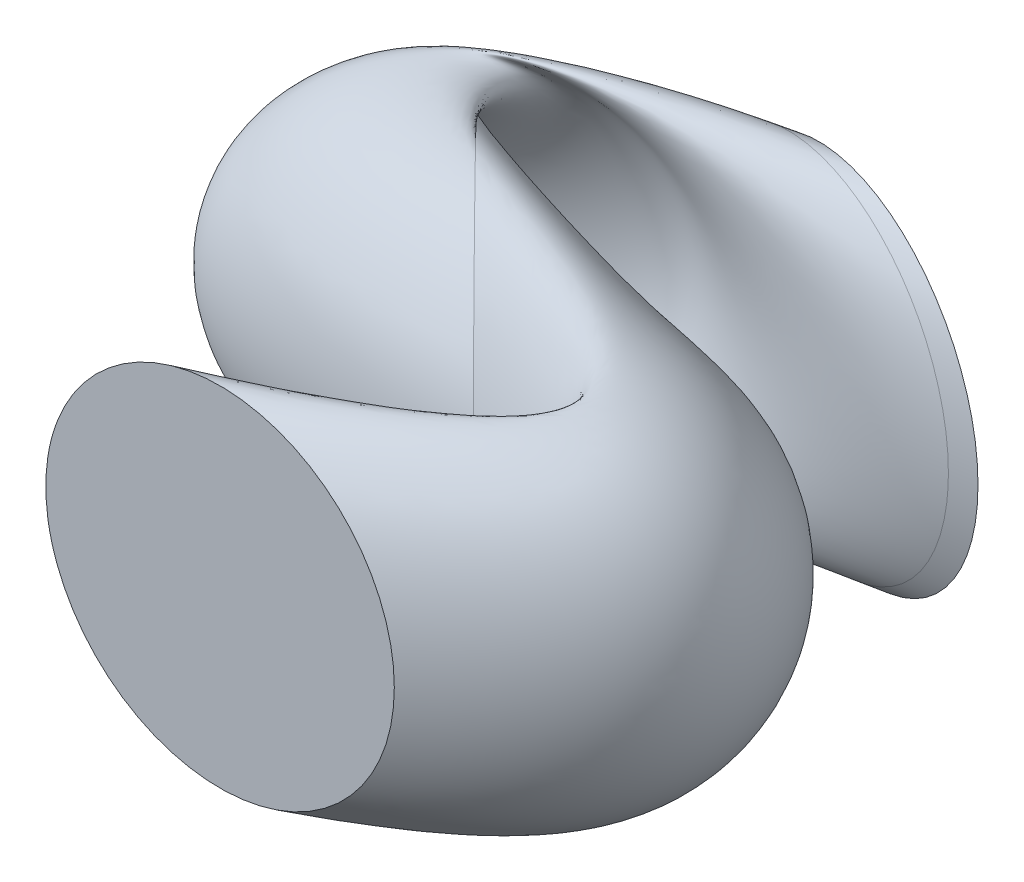
ISO-10303-21;
HEADER;
FILE_DESCRIPTION(('STEP AP214'),'2;1');
FILE_NAME('part.step','',(''),(''),'','','');
FILE_SCHEMA(('AUTOMOTIVE_DESIGN { 1 0 10303 214 1 1 1 1 }'));
ENDSEC;
DATA;
#1=APPLICATION_CONTEXT('core data for automotive mechanical design processes');
#2=APPLICATION_PROTOCOL_DEFINITION('international standard','automotive_design',2000,#1);
#3=PRODUCT_CONTEXT('',#1,'mechanical');
#4=PRODUCT('Part','Part','',(#3));
#5=PRODUCT_RELATED_PRODUCT_CATEGORY('part','',(#4));
#6=PRODUCT_DEFINITION_FORMATION('','',#4);
#7=PRODUCT_DEFINITION_CONTEXT('part definition',#1,'design');
#8=PRODUCT_DEFINITION('design','',#6,#7);
#9=PRODUCT_DEFINITION_SHAPE('','',#8);
#10=(LENGTH_UNIT() NAMED_UNIT(*) SI_UNIT(.MILLI.,.METRE.));
#11=(NAMED_UNIT(*) PLANE_ANGLE_UNIT() SI_UNIT($,.RADIAN.));
#12=(NAMED_UNIT(*) SI_UNIT($,.STERADIAN.) SOLID_ANGLE_UNIT());
#13=UNCERTAINTY_MEASURE_WITH_UNIT(LENGTH_MEASURE(1.E-05),#10,'distance_accuracy_value','');
#14=(GEOMETRIC_REPRESENTATION_CONTEXT(3) GLOBAL_UNCERTAINTY_ASSIGNED_CONTEXT((#13)) GLOBAL_UNIT_ASSIGNED_CONTEXT((#10,
#11,#12)) REPRESENTATION_CONTEXT('',''));
#15=CARTESIAN_POINT('',(0.,0.,0.));
#16=DIRECTION('',(0.,0.,1.));
#17=DIRECTION('',(1.,0.,0.));
#18=AXIS2_PLACEMENT_3D('',#15,#16,#17);
#19=CARTESIAN_POINT('',(13.8441242664834,0.,-58.1458268293369));
#20=DIRECTION('',(-0.224688082587893,0.,0.974430739223151));
#21=DIRECTION('',(0.974430739223151,0.,0.224688082587893));
#22=AXIS2_PLACEMENT_3D('',#19,#20,#21);
#23=PLANE('',#22);
#24=CARTESIAN_POINT('',(13.8441242664834,0.,-58.1458268293369));
#25=DIRECTION('',(0.224688082587893,0.,-0.974430739223151));
#26=DIRECTION('',(0.974430739223151,0.,0.224688082587893));
#27=AXIS2_PLACEMENT_3D('',#24,#25,#26);
#28=CIRCLE('',#27,20.);
#29=CARTESIAN_POINT('',(33.3327390509464,0.,-53.652065177579));
#30=VERTEX_POINT('',#29);
#31=EDGE_CURVE('E40',#30,#30,#28,.T.);
#32=ORIENTED_EDGE('',*,*,#31,.T.);
#33=EDGE_LOOP('',(#32));
#34=FACE_BOUND('',#33,.T.);
#35=ADVANCED_FACE('F37',(#34),#23,.F.);
#36=CARTESIAN_POINT('',(0.,0.,0.));
#37=DIRECTION('',(0.,0.,1.));
#38=DIRECTION('',(1.,0.,0.));
#39=AXIS2_PLACEMENT_3D('',#36,#37,#38);
#40=PLANE('',#39);
#41=CARTESIAN_POINT('',(0.,0.,0.));
#42=DIRECTION('',(0.,0.,1.));
#43=DIRECTION('',(1.,0.,0.));
#44=AXIS2_PLACEMENT_3D('',#41,#42,#43);
#45=CIRCLE('',#44,20.);
#46=CARTESIAN_POINT('',(20.,0.,0.));
#47=VERTEX_POINT('',#46);
#48=EDGE_CURVE('E51',#47,#47,#45,.T.);
#49=ORIENTED_EDGE('',*,*,#48,.T.);
#50=EDGE_LOOP('',(#49));
#51=FACE_BOUND('',#50,.T.);
#52=ADVANCED_FACE('F75',(#51),#40,.T.);
#53=CARTESIAN_POINT('',(30.4504022753852,0.,-53.1366231177138));
#54=CARTESIAN_POINT('',(31.3857494045259,0.,-53.3043710455547));
#55=CARTESIAN_POINT('',(32.3463716766783,0.,-53.4762856240853));
#56=CARTESIAN_POINT('',(33.3327390509464,0.,-53.652065177579));
#57=CARTESIAN_POINT('',(30.4504022753852,40.,-53.1366231177138));
#58=CARTESIAN_POINT('',(31.3857494045259,40.,-53.3043710455547));
#59=CARTESIAN_POINT('',(32.3463716766783,40.,-53.4762856240853));
#60=CARTESIAN_POINT('',(33.3327390509464,40.,-53.652065177579));
#61=CARTESIAN_POINT('',(-8.5843094441241,40.,-61.872315470607));
#62=CARTESIAN_POINT('',(-7.62921496120596,40.,-62.1276344761548));
#63=CARTESIAN_POINT('',(-6.64943285895494,40.,-62.3832527257945));
#64=CARTESIAN_POINT('',(-5.64449051797965,40.,-62.6395884810947));
#65=CARTESIAN_POINT('',(-8.584309444126,0.,-61.872315470607));
#66=CARTESIAN_POINT('',(-7.62921496120746,0.,-62.1276344761548));
#67=CARTESIAN_POINT('',(-6.64943285895583,0.,-62.3832527257945));
#68=CARTESIAN_POINT('',(-5.64449051797965,0.,-62.6395884810947));
#69=CARTESIAN_POINT('',(-8.58430944412789,-40.,-61.872315470607));
#70=CARTESIAN_POINT('',(-7.62921496120896,-40.,-62.1276344761548));
#71=CARTESIAN_POINT('',(-6.64943285895671,-40.,-62.3832527257945));
#72=CARTESIAN_POINT('',(-5.64449051797966,-40.,-62.6395884810947));
#73=CARTESIAN_POINT('',(30.4504022753852,-40.,-53.1366231177138));
#74=CARTESIAN_POINT('',(31.3857494045259,-40.,-53.3043710455547));
#75=CARTESIAN_POINT('',(32.3463716766783,-40.,-53.4762856240853));
#76=CARTESIAN_POINT('',(33.3327390509464,-40.,-53.652065177579));
#77=CARTESIAN_POINT('',(30.4504022753852,0.,-53.1366231177138));
#78=CARTESIAN_POINT('',(31.3857494045259,0.,-53.3043710455547));
#79=CARTESIAN_POINT('',(32.3463716766783,0.,-53.4762856240853));
#80=CARTESIAN_POINT('',(33.3327390509464,0.,-53.652065177579));
#81=(BOUNDED_SURFACE() B_SPLINE_SURFACE(3,3,((#53,#54,#55,#56),(#57,#58,#59,#60),(#61,#62,#63,
#64),(#65,#66,#67,#68),(#69,#70,#71,#72),(#73,#74,#75,#76),(#77,#78,#79,#80)),.UNSPECIFIED.,.T.,
.F.,.F.) B_SPLINE_SURFACE_WITH_KNOTS((4,3,4),(4,4),(0.,0.5,1.),(0.990343472065436,1.),
.UNSPECIFIED.) GEOMETRIC_REPRESENTATION_ITEM() RATIONAL_B_SPLINE_SURFACE(((1.,1.,1.,1.),
(0.333333333333333,0.333333333333333,0.333333333333333,0.333333333333333),(0.333333333333333,
0.333333333333333,0.333333333333333,0.333333333333333),(1.,1.,1.,1.),(0.333333333333333,
0.333333333333333,0.333333333333333,0.333333333333333),(0.333333333333333,0.333333333333333,
0.333333333333333,0.333333333333333),(1.,1.,1.,1.))) REPRESENTATION_ITEM('') SURFACE());
#82=CARTESIAN_POINT('',(30.4504022753852,0.,-53.1366231177138));
#83=CARTESIAN_POINT('',(30.4504022753852,40.,-53.1366231177138));
#84=CARTESIAN_POINT('',(-8.5843094441241,40.,-61.872315470607));
#85=CARTESIAN_POINT('',(-8.584309444126,0.,-61.872315470607));
#86=CARTESIAN_POINT('',(-8.58430944412789,-40.,-61.872315470607));
#87=CARTESIAN_POINT('',(30.4504022753852,-40.,-53.1366231177138));
#88=CARTESIAN_POINT('',(30.4504022753852,0.,-53.1366231177138));
#89=(BOUNDED_CURVE() B_SPLINE_CURVE(3,(#82,#83,#84,#85,#86,#87,#88),.UNSPECIFIED.,.T.,
.F.) B_SPLINE_CURVE_WITH_KNOTS((4,3,4),(0.,0.5,1.),
.UNSPECIFIED.) CURVE() GEOMETRIC_REPRESENTATION_ITEM() RATIONAL_B_SPLINE_CURVE((1.,
0.333333333333333,0.333333333333333,1.,0.333333333333333,0.333333333333333,1.)) REPRESENTATION_ITEM(''));
#90=CARTESIAN_POINT('',(30.4504022753852,0.,-53.1366231177138));
#91=VERTEX_POINT('',#90);
#92=EDGE_CURVE('E45',#91,#91,#89,.F.);
#93=ORIENTED_EDGE('',*,*,#92,.T.);
#94=EDGE_LOOP('',(#93));
#95=FACE_BOUND('',#94,.T.);
#96=ORIENTED_EDGE('',*,*,#31,.F.);
#97=EDGE_LOOP('',(#96));
#98=FACE_BOUND('',#97,.T.);
#99=ADVANCED_FACE('F72',(#95,#98),#81,.F.);
#100=CARTESIAN_POINT('',(20.,0.,0.));
#101=CARTESIAN_POINT('',(25.0365918982649,0.,-3.03165709130013));
#102=CARTESIAN_POINT('',(29.0759854249937,0.,-6.07041859505571));
#103=CARTESIAN_POINT('',(33.6478199205941,0.,-10.9648813524956));
#104=CARTESIAN_POINT('',(34.9222250835118,0.,-12.6552835014459));
#105=CARTESIAN_POINT('',(36.9057758022614,0.,-16.2431691540445));
#106=CARTESIAN_POINT('',(37.6173397847427,0.,-18.1433447506427));
#107=CARTESIAN_POINT('',(38.2991384571099,0.,-22.2339251793245));
#108=CARTESIAN_POINT('',(38.2669505958936,0.,-24.4348190151614));
#109=CARTESIAN_POINT('',(37.135446045738,0.,-29.0266259833127));
#110=CARTESIAN_POINT('',(36.0091371118412,0.,-31.4225729888314));
#111=CARTESIAN_POINT('',(32.5829885187639,0.,-35.7782818550101));
#112=CARTESIAN_POINT('',(30.2837609777363,0.,-37.69040882244));
#113=CARTESIAN_POINT('',(25.3783301723491,0.,-40.4703872401459));
#114=CARTESIAN_POINT('',(22.8253561658358,0.,-41.3502910609969));
#115=CARTESIAN_POINT('',(18.1967440529606,0.,-42.4974150564184));
#116=CARTESIAN_POINT('',(16.1049015596778,0.,-42.79292783196));
#117=CARTESIAN_POINT('',(12.3341861854068,0.,-43.2608408180772));
#118=CARTESIAN_POINT('',(10.6410978113674,0.,-43.4297448619512));
#119=CARTESIAN_POINT('',(5.86949034292189,0.,-43.9792683181594));
#120=CARTESIAN_POINT('',(3.05992904856021,0.,-44.4034303540617));
#121=CARTESIAN_POINT('',(-2.48879645843026,0.,-45.4707304800752));
#122=CARTESIAN_POINT('',(-5.20565146416229,0.,-46.0951272486904));
#123=CARTESIAN_POINT('',(-10.5586090776454,0.,-47.4746032726023));
#124=CARTESIAN_POINT('',(-13.1882317627609,0.,-48.2286294172799));
#125=CARTESIAN_POINT('',(-17.9272027145122,0.,-49.7979306307947));
#126=CARTESIAN_POINT('',(-20.0634375584977,0.,-50.5994075319267));
#127=CARTESIAN_POINT('',(-21.9575320347361,0.,-51.4941925753627));
#128=CARTESIAN_POINT('',(20.,40.,0.));
#129=CARTESIAN_POINT('',(25.0365918982649,40.,-3.03165709130013));
#130=CARTESIAN_POINT('',(29.0759854249937,40.,-6.07041859505571));
#131=CARTESIAN_POINT('',(33.6478199205941,40.,-10.9648813524956));
#132=CARTESIAN_POINT('',(34.9222250835118,40.,-12.6552835014459));
#133=CARTESIAN_POINT('',(36.9057758022614,40.,-16.2431691540445));
#134=CARTESIAN_POINT('',(37.6173397847427,40.,-18.1433447506427));
#135=CARTESIAN_POINT('',(38.2991384571099,40.,-22.2339251793245));
#136=CARTESIAN_POINT('',(38.2669505958936,40.,-24.4348190151614));
#137=CARTESIAN_POINT('',(37.135446045738,40.,-29.0266259833127));
#138=CARTESIAN_POINT('',(36.0091371118412,40.,-31.4225729888314));
#139=CARTESIAN_POINT('',(32.5829885187639,40.,-35.7782818550101));
#140=CARTESIAN_POINT('',(30.2837609777363,40.,-37.69040882244));
#141=CARTESIAN_POINT('',(25.3783301723491,40.,-40.4703872401459));
#142=CARTESIAN_POINT('',(22.8253561658358,40.,-41.3502910609969));
#143=CARTESIAN_POINT('',(18.1967440529606,40.,-42.4974150564184));
#144=CARTESIAN_POINT('',(16.1049015596778,40.,-42.79292783196));
#145=CARTESIAN_POINT('',(12.3341861854068,40.,-43.2608408180772));
#146=CARTESIAN_POINT('',(10.6410978113674,40.,-43.4297448619512));
#147=CARTESIAN_POINT('',(5.86949034292189,40.,-43.9792683181594));
#148=CARTESIAN_POINT('',(3.05992904856021,40.,-44.4034303540617));
#149=CARTESIAN_POINT('',(-2.48879645843026,40.,-45.4707304800752));
#150=CARTESIAN_POINT('',(-5.20565146416229,40.,-46.0951272486904));
#151=CARTESIAN_POINT('',(-10.5586090776454,40.,-47.4746032726023));
#152=CARTESIAN_POINT('',(-13.1882317627609,40.,-48.2286294172799));
#153=CARTESIAN_POINT('',(-17.9272027145122,40.,-49.7979306307947));
#154=CARTESIAN_POINT('',(-20.0634375584977,40.,-50.5994075319267));
#155=CARTESIAN_POINT('',(-21.9575320347361,40.,-51.4941925753627));
#156=CARTESIAN_POINT('',(-20.,40.,0.));
#157=CARTESIAN_POINT('',(-14.9634081020248,40.,-1.7144226520466));
#158=CARTESIAN_POINT('',(-10.8861314018475,40.,-3.10794629958036));
#159=CARTESIAN_POINT('',(-5.83438941371429,40.,-4.43863420259872));
#160=CARTESIAN_POINT('',(-4.32617389284461,40.,-4.75273609587769));
#161=CARTESIAN_POINT('',(-1.53106927774256,40.,-5.0406686427995));
#162=CARTESIAN_POINT('',(-0.246598613306679,40.,-5.01180720309518));
#163=CARTESIAN_POINT('',(2.34097622546923,40.,-4.53856767368981));
#164=CARTESIAN_POINT('',(3.6465029459369,40.,-4.08370057962777));
#165=CARTESIAN_POINT('',(6.66587968390123,40.,-2.86656215108911));
#166=CARTESIAN_POINT('',(8.40672193862191,40.,-2.0992569424531));
#167=CARTESIAN_POINT('',(12.4670218953677,40.,-0.891349196742885));
#168=CARTESIAN_POINT('',(14.7858674684777,40.,-0.498381551589638));
#169=CARTESIAN_POINT('',(19.1995093118723,40.,-0.65514177567005));
#170=CARTESIAN_POINT('',(21.241076311995,40.,-1.19281727283163));
#171=CARTESIAN_POINT('',(24.3797396352455,40.,-2.78717438092215));
#172=CARTESIAN_POINT('',(25.4930403338494,40.,-3.81556338947047));
#173=CARTESIAN_POINT('',(26.9034275895101,40.,-5.9096789090539));
#174=CARTESIAN_POINT('',(27.2147296302214,40.,-6.97890158563388));
#175=CARTESIAN_POINT('',(27.3319466759536,40.,-10.026949402036));
#176=CARTESIAN_POINT('',(26.3598724355298,40.,-11.8454230268064));
#177=CARTESIAN_POINT('',(23.4990317212915,40.,-15.0151236117485));
#178=CARTESIAN_POINT('',(21.5879560299415,40.,-16.3850918921629));
#179=CARTESIAN_POINT('',(17.3498790910115,40.,-18.8092951174878));
#180=CARTESIAN_POINT('',(15.0163979120549,40.,-19.8645831721371));
#181=CARTESIAN_POINT('',(10.468978192291,40.,-21.6257192629929));
#182=CARTESIAN_POINT('',(8.26598117957627,40.,-22.3564061858675));
#183=CARTESIAN_POINT('',(6.08220536175989,40.,-22.9673283011287));
#184=CARTESIAN_POINT('',(-20.,0.,0.));
#185=CARTESIAN_POINT('',(-14.9634081020248,0.,-1.7144226520466));
#186=CARTESIAN_POINT('',(-10.8861314018475,0.,-3.10794629958118));
#187=CARTESIAN_POINT('',(-5.83438941371429,0.,-4.43863420259831));
#188=CARTESIAN_POINT('',(-4.32617389284462,0.,-4.75273609587769));
#189=CARTESIAN_POINT('',(-1.53106927774257,0.,-5.0406686427995));
#190=CARTESIAN_POINT('',(-0.246598613306682,0.,-5.01180720309491));
#191=CARTESIAN_POINT('',(2.34097622546923,0.,-4.53856767369007));
#192=CARTESIAN_POINT('',(3.64650294593689,0.,-4.08370057962819));
#193=CARTESIAN_POINT('',(6.66587968390123,0.,-2.86656215108869));
#194=CARTESIAN_POINT('',(8.40672193862156,0.,-2.0992569424531));
#195=CARTESIAN_POINT('',(12.4670218953681,0.,-0.891349196742881));
#196=CARTESIAN_POINT('',(14.7858674684771,0.,-0.49838155159028));
#197=CARTESIAN_POINT('',(19.199509311873,0.,-0.655141775669401));
#198=CARTESIAN_POINT('',(21.241076311995,0.,-1.19281727283163));
#199=CARTESIAN_POINT('',(24.3797396352455,0.,-2.78717438092214));
#200=CARTESIAN_POINT('',(25.4930403338494,0.,-3.81556338946971));
#201=CARTESIAN_POINT('',(26.9034275895101,0.,-5.90967890905465));
#202=CARTESIAN_POINT('',(27.2147296302214,0.,-6.97890158563388));
#203=CARTESIAN_POINT('',(27.3319466759536,0.,-10.026949402036));
#204=CARTESIAN_POINT('',(26.3598724355298,0.,-11.8454230268085));
#205=CARTESIAN_POINT('',(23.4990317212915,0.,-15.0151236117464));
#206=CARTESIAN_POINT('',(21.5879560299392,0.,-16.3850918921629));
#207=CARTESIAN_POINT('',(17.3498790910137,0.,-18.8092951174878));
#208=CARTESIAN_POINT('',(15.0163979120549,0.,-19.8645831721371));
#209=CARTESIAN_POINT('',(10.468978192291,0.,-21.6257192629929));
#210=CARTESIAN_POINT('',(8.26598117957627,0.,-22.3564061858675));
#211=CARTESIAN_POINT('',(6.08220536175989,0.,-22.9673283011287));
#212=CARTESIAN_POINT('',(-20.,-40.,0.));
#213=CARTESIAN_POINT('',(-14.9634081020248,-40.,-1.7144226520466));
#214=CARTESIAN_POINT('',(-10.8861314018475,-40.,-3.10794629958201));
#215=CARTESIAN_POINT('',(-5.83438941371429,-40.,-4.43863420259789));
#216=CARTESIAN_POINT('',(-4.32617389284462,-40.,-4.75273609587768));
#217=CARTESIAN_POINT('',(-1.53106927774257,-40.,-5.0406686427995));
#218=CARTESIAN_POINT('',(-0.246598613306685,-40.,-5.01180720309465));
#219=CARTESIAN_POINT('',(2.34097622546922,-40.,-4.53856767369034));
#220=CARTESIAN_POINT('',(3.64650294593689,-40.,-4.0837005796286));
#221=CARTESIAN_POINT('',(6.66587968390122,-40.,-2.86656215108827));
#222=CARTESIAN_POINT('',(8.40672193862121,-40.,-2.0992569424531));
#223=CARTESIAN_POINT('',(12.4670218953684,-40.,-0.891349196742878));
#224=CARTESIAN_POINT('',(14.7858674684765,-40.,-0.498381551590922));
#225=CARTESIAN_POINT('',(19.1995093118736,-40.,-0.655141775668752));
#226=CARTESIAN_POINT('',(21.241076311995,-40.,-1.19281727283162));
#227=CARTESIAN_POINT('',(24.3797396352455,-40.,-2.78717438092214));
#228=CARTESIAN_POINT('',(25.4930403338494,-40.,-3.81556338946895));
#229=CARTESIAN_POINT('',(26.9034275895101,-40.,-5.9096789090554));
#230=CARTESIAN_POINT('',(27.2147296302214,-40.,-6.97890158563388));
#231=CARTESIAN_POINT('',(27.3319466759536,-40.,-10.026949402036));
#232=CARTESIAN_POINT('',(26.3598724355298,-40.,-11.8454230268105));
#233=CARTESIAN_POINT('',(23.4990317212915,-40.,-15.0151236117444));
#234=CARTESIAN_POINT('',(21.587956029937,-40.,-16.3850918921629));
#235=CARTESIAN_POINT('',(17.3498790910159,-40.,-18.8092951174878));
#236=CARTESIAN_POINT('',(15.0163979120549,-40.,-19.8645831721371));
#237=CARTESIAN_POINT('',(10.468978192291,-40.,-21.6257192629929));
#238=CARTESIAN_POINT('',(8.26598117957628,-40.,-22.3564061858675));
#239=CARTESIAN_POINT('',(6.08220536175989,-40.,-22.9673283011287));
#240=CARTESIAN_POINT('',(20.,-40.,0.));
#241=CARTESIAN_POINT('',(25.0365918982649,-40.,-3.03165709130013));
#242=CARTESIAN_POINT('',(29.0759854249937,-40.,-6.07041859505571));
#243=CARTESIAN_POINT('',(33.6478199205941,-40.,-10.9648813524956));
#244=CARTESIAN_POINT('',(34.9222250835118,-40.,-12.6552835014459));
#245=CARTESIAN_POINT('',(36.9057758022614,-40.,-16.2431691540445));
#246=CARTESIAN_POINT('',(37.6173397847427,-40.,-18.1433447506427));
#247=CARTESIAN_POINT('',(38.2991384571099,-40.,-22.2339251793245));
#248=CARTESIAN_POINT('',(38.2669505958936,-40.,-24.4348190151614));
#249=CARTESIAN_POINT('',(37.135446045738,-40.,-29.0266259833127));
#250=CARTESIAN_POINT('',(36.0091371118412,-40.,-31.4225729888314));
#251=CARTESIAN_POINT('',(32.5829885187639,-40.,-35.7782818550101));
#252=CARTESIAN_POINT('',(30.2837609777363,-40.,-37.69040882244));
#253=CARTESIAN_POINT('',(25.3783301723491,-40.,-40.4703872401459));
#254=CARTESIAN_POINT('',(22.8253561658358,-40.,-41.3502910609969));
#255=CARTESIAN_POINT('',(18.1967440529606,-40.,-42.4974150564184));
#256=CARTESIAN_POINT('',(16.1049015596778,-40.,-42.79292783196));
#257=CARTESIAN_POINT('',(12.3341861854068,-40.,-43.2608408180772));
#258=CARTESIAN_POINT('',(10.6410978113674,-40.,-43.4297448619512));
#259=CARTESIAN_POINT('',(5.86949034292189,-40.,-43.9792683181594));
#260=CARTESIAN_POINT('',(3.05992904856021,-40.,-44.4034303540617));
#261=CARTESIAN_POINT('',(-2.48879645843026,-40.,-45.4707304800752));
#262=CARTESIAN_POINT('',(-5.20565146416229,-40.,-46.0951272486904));
#263=CARTESIAN_POINT('',(-10.5586090776454,-40.,-47.4746032726023));
#264=CARTESIAN_POINT('',(-13.1882317627609,-40.,-48.2286294172799));
#265=CARTESIAN_POINT('',(-17.9272027145122,-40.,-49.7979306307947));
#266=CARTESIAN_POINT('',(-20.0634375584977,-40.,-50.5994075319267));
#267=CARTESIAN_POINT('',(-21.9575320347361,-40.,-51.4941925753627));
#268=CARTESIAN_POINT('',(20.,0.,0.));
#269=CARTESIAN_POINT('',(25.0365918982649,0.,-3.03165709130013));
#270=CARTESIAN_POINT('',(29.0759854249937,0.,-6.07041859505571));
#271=CARTESIAN_POINT('',(33.6478199205941,0.,-10.9648813524956));
#272=CARTESIAN_POINT('',(34.9222250835118,0.,-12.6552835014459));
#273=CARTESIAN_POINT('',(36.9057758022614,0.,-16.2431691540445));
#274=CARTESIAN_POINT('',(37.6173397847427,0.,-18.1433447506427));
#275=CARTESIAN_POINT('',(38.2991384571099,0.,-22.2339251793245));
#276=CARTESIAN_POINT('',(38.2669505958936,0.,-24.4348190151614));
#277=CARTESIAN_POINT('',(37.135446045738,0.,-29.0266259833127));
#278=CARTESIAN_POINT('',(36.0091371118412,0.,-31.4225729888314));
#279=CARTESIAN_POINT('',(32.5829885187639,0.,-35.7782818550101));
#280=CARTESIAN_POINT('',(30.2837609777363,0.,-37.69040882244));
#281=CARTESIAN_POINT('',(25.3783301723491,0.,-40.4703872401459));
#282=CARTESIAN_POINT('',(22.8253561658358,0.,-41.3502910609969));
#283=CARTESIAN_POINT('',(18.1967440529606,0.,-42.4974150564184));
#284=CARTESIAN_POINT('',(16.1049015596778,0.,-42.79292783196));
#285=CARTESIAN_POINT('',(12.3341861854068,0.,-43.2608408180772));
#286=CARTESIAN_POINT('',(10.6410978113674,0.,-43.4297448619512));
#287=CARTESIAN_POINT('',(5.86949034292189,0.,-43.9792683181594));
#288=CARTESIAN_POINT('',(3.05992904856021,0.,-44.4034303540617));
#289=CARTESIAN_POINT('',(-2.48879645843026,0.,-45.4707304800752));
#290=CARTESIAN_POINT('',(-5.20565146416229,0.,-46.0951272486904));
#291=CARTESIAN_POINT('',(-10.5586090776454,0.,-47.4746032726023));
#292=CARTESIAN_POINT('',(-13.1882317627609,0.,-48.2286294172799));
#293=CARTESIAN_POINT('',(-17.9272027145122,0.,-49.7979306307947));
#294=CARTESIAN_POINT('',(-20.0634375584977,0.,-50.5994075319267));
#295=CARTESIAN_POINT('',(-21.9575320347361,0.,-51.4941925753627));
#296=(BOUNDED_SURFACE() B_SPLINE_SURFACE(3,3,((#100,#101,#102,#103,#104,#105,#106,#107,#108,
#109,#110,#111,#112,#113,#114,#115,#116,#117,#118,#119,#120,#121,#122,#123,#124,#125,#126,#127),
(#128,#129,#130,#131,#132,#133,#134,#135,#136,#137,#138,#139,#140,#141,#142,#143,#144,#145,#146,
#147,#148,#149,#150,#151,#152,#153,#154,#155),(#156,#157,#158,#159,#160,#161,#162,#163,#164,
#165,#166,#167,#168,#169,#170,#171,#172,#173,#174,#175,#176,#177,#178,#179,#180,#181,#182,#183),
(#184,#185,#186,#187,#188,#189,#190,#191,#192,#193,#194,#195,#196,#197,#198,#199,#200,#201,#202,
#203,#204,#205,#206,#207,#208,#209,#210,#211),(#212,#213,#214,#215,#216,#217,#218,#219,#220,
#221,#222,#223,#224,#225,#226,#227,#228,#229,#230,#231,#232,#233,#234,#235,#236,#237,#238,#239),
(#240,#241,#242,#243,#244,#245,#246,#247,#248,#249,#250,#251,#252,#253,#254,#255,#256,#257,#258,
#259,#260,#261,#262,#263,#264,#265,#266,#267),(#268,#269,#270,#271,#272,#273,#274,#275,#276,
#277,#278,#279,#280,#281,#282,#283,#284,#285,#286,#287,#288,#289,#290,#291,#292,#293,#294,
#295)),.UNSPECIFIED.,.T.,.F.,.F.) B_SPLINE_SURFACE_WITH_KNOTS((4,3,4),(4,2,2,2,2,2,2,2,2,2,2,2,
2,4),(0.,0.5,1.),(0.,0.0625,0.09375,0.125,0.15625,0.1875,0.21875,0.25,0.28125,0.3125,0.375,
0.4375,0.5,0.556553129452557),
.UNSPECIFIED.) GEOMETRIC_REPRESENTATION_ITEM() RATIONAL_B_SPLINE_SURFACE(((1.,1.,1.,1.,1.,1.,1.,
1.,1.,1.,1.,1.,1.,1.,1.,1.,1.,1.,1.,1.,1.,1.,1.,1.,1.,1.,1.,1.),(0.333333333333333,
0.333333333333333,0.333333333333333,0.333333333333333,0.333333333333333,0.333333333333333,
0.333333333333333,0.333333333333333,0.333333333333333,0.333333333333333,0.333333333333333,
0.333333333333333,0.333333333333333,0.333333333333333,0.333333333333333,0.333333333333333,
0.333333333333333,0.333333333333333,0.333333333333333,0.333333333333333,0.333333333333333,
0.333333333333333,0.333333333333333,0.333333333333333,0.333333333333333,0.333333333333333,
0.333333333333333,0.333333333333333),(0.333333333333333,0.333333333333333,0.333333333333333,
0.333333333333333,0.333333333333333,0.333333333333333,0.333333333333333,0.333333333333333,
0.333333333333333,0.333333333333333,0.333333333333333,0.333333333333333,0.333333333333333,
0.333333333333333,0.333333333333333,0.333333333333333,0.333333333333333,0.333333333333333,
0.333333333333333,0.333333333333333,0.333333333333333,0.333333333333333,0.333333333333333,
0.333333333333333,0.333333333333333,0.333333333333333,0.333333333333333,0.333333333333333),(1.,
1.,1.,1.,1.,1.,1.,1.,1.,1.,1.,1.,1.,1.,1.,1.,1.,1.,1.,1.,1.,1.,1.,1.,1.,1.,1.,1.),
(0.333333333333333,0.333333333333333,0.333333333333333,0.333333333333333,0.333333333333333,
0.333333333333333,0.333333333333333,0.333333333333333,0.333333333333333,0.333333333333333,
0.333333333333333,0.333333333333333,0.333333333333333,0.333333333333333,0.333333333333333,
0.333333333333333,0.333333333333333,0.333333333333333,0.333333333333333,0.333333333333333,
0.333333333333333,0.333333333333333,0.333333333333333,0.333333333333333,0.333333333333333,
0.333333333333333,0.333333333333333,0.333333333333333),(0.333333333333333,0.333333333333333,
0.333333333333333,0.333333333333333,0.333333333333333,0.333333333333333,0.333333333333333,
0.333333333333333,0.333333333333333,0.333333333333333,0.333333333333333,0.333333333333333,
0.333333333333333,0.333333333333333,0.333333333333333,0.333333333333333,0.333333333333333,
0.333333333333333,0.333333333333333,0.333333333333333,0.333333333333333,0.333333333333333,
0.333333333333333,0.333333333333333,0.333333333333333,0.333333333333333,0.333333333333333,
0.333333333333333),(1.,1.,1.,1.,1.,1.,1.,1.,1.,1.,1.,1.,1.,1.,1.,1.,1.,1.,1.,1.,1.,1.,1.,1.,1.,
1.,1.,1.))) REPRESENTATION_ITEM('') SURFACE());
#297=CARTESIAN_POINT('',(-21.9575320347361,0.,-51.4941925753627));
#298=CARTESIAN_POINT('',(-21.9575320347361,40.,-51.4941925753627));
#299=CARTESIAN_POINT('',(6.08220536175989,40.,-22.9673283011287));
#300=CARTESIAN_POINT('',(6.08220536175989,0.,-22.9673283011287));
#301=CARTESIAN_POINT('',(6.08220536175989,-40.,-22.9673283011287));
#302=CARTESIAN_POINT('',(-21.9575320347361,-40.,-51.4941925753627));
#303=CARTESIAN_POINT('',(-21.9575320347361,0.,-51.4941925753627));
#304=(BOUNDED_CURVE() B_SPLINE_CURVE(3,(#297,#298,#299,#300,#301,#302,#303),.UNSPECIFIED.,.T.,
.F.) B_SPLINE_CURVE_WITH_KNOTS((4,3,4),(0.,0.5,1.),
.UNSPECIFIED.) CURVE() GEOMETRIC_REPRESENTATION_ITEM() RATIONAL_B_SPLINE_CURVE((1.,
0.333333333333333,0.333333333333333,1.,0.333333333333333,0.333333333333333,1.)) REPRESENTATION_ITEM(''));
#305=CARTESIAN_POINT('',(-21.9575320347361,0.,-51.4941925753627));
#306=VERTEX_POINT('',#305);
#307=EDGE_CURVE('E10',#306,#306,#304,.T.);
#308=ORIENTED_EDGE('',*,*,#48,.F.);
#309=EDGE_LOOP('',(#308));
#310=FACE_BOUND('',#309,.T.);
#311=ORIENTED_EDGE('',*,*,#307,.T.);
#312=EDGE_LOOP('',(#311));
#313=FACE_BOUND('',#312,.T.);
#314=ADVANCED_FACE('F74',(#310,#313),#296,.F.);
#315=CARTESIAN_POINT('',(-21.9575320347361,0.,-51.4941925753627));
#316=CARTESIAN_POINT('',(-16.919656415708,0.,-56.2003045966673));
#317=CARTESIAN_POINT('',(-6.84390517765172,0.,-65.6125286392764));
#318=CARTESIAN_POINT('',(9.44158034884031,0.,-49.3688386933431));
#319=CARTESIAN_POINT('',(30.4504022753852,0.,-53.1366231177138));
#320=CARTESIAN_POINT('',(-21.9575320347361,40.,-51.4941925753627));
#321=CARTESIAN_POINT('',(-16.919656415708,40.,-56.2003045966673));
#322=CARTESIAN_POINT('',(-6.84390517765173,40.,-65.6125286392764));
#323=CARTESIAN_POINT('',(9.44158034884031,40.,-49.368838693343));
#324=CARTESIAN_POINT('',(30.4504022753852,40.,-53.1366231177138));
#325=CARTESIAN_POINT('',(6.08220536175989,40.,-22.9673283011287));
#326=CARTESIAN_POINT('',(-12.3985084436571,40.,-23.8136000821162));
#327=CARTESIAN_POINT('',(-49.3599360544912,40.,-25.5061436440912));
#328=CARTESIAN_POINT('',(-30.0366764739849,40.,-56.137598000587));
#329=CARTESIAN_POINT('',(-8.5843094441241,40.,-61.872315470607));
#330=CARTESIAN_POINT('',(6.08220536175989,0.,-22.9673283011287));
#331=CARTESIAN_POINT('',(-12.3985084436557,0.,-23.8136000821162));
#332=CARTESIAN_POINT('',(-49.3599360544868,0.,-25.5061436440912));
#333=CARTESIAN_POINT('',(-30.0366764739958,0.,-56.137598000587));
#334=CARTESIAN_POINT('',(-8.584309444126,0.,-61.872315470607));
#335=CARTESIAN_POINT('',(6.08220536175989,-40.,-22.9673283011287));
#336=CARTESIAN_POINT('',(-12.3985084436542,-40.,-23.8136000821162));
#337=CARTESIAN_POINT('',(-49.3599360544825,-40.,-25.5061436440912));
#338=CARTESIAN_POINT('',(-30.0366764740067,-40.,-56.137598000587));
#339=CARTESIAN_POINT('',(-8.58430944412789,-40.,-61.872315470607));
#340=CARTESIAN_POINT('',(-21.9575320347361,-40.,-51.4941925753627));
#341=CARTESIAN_POINT('',(-16.919656415708,-40.,-56.2003045966673));
#342=CARTESIAN_POINT('',(-6.84390517765173,-40.,-65.6125286392764));
#343=CARTESIAN_POINT('',(9.44158034884031,-40.,-49.368838693343));
#344=CARTESIAN_POINT('',(30.4504022753852,-40.,-53.1366231177138));
#345=CARTESIAN_POINT('',(-21.9575320347361,0.,-51.4941925753627));
#346=CARTESIAN_POINT('',(-16.919656415708,0.,-56.2003045966673));
#347=CARTESIAN_POINT('',(-6.84390517765172,0.,-65.6125286392764));
#348=CARTESIAN_POINT('',(9.44158034884031,0.,-49.3688386933431));
#349=CARTESIAN_POINT('',(30.4504022753852,0.,-53.1366231177138));
#350=(BOUNDED_SURFACE() B_SPLINE_SURFACE(3,3,((#315,#316,#317,#318,#319),(#320,#321,#322,#323,
#324),(#325,#326,#327,#328,#329),(#330,#331,#332,#333,#334),(#335,#336,#337,#338,#339),(#340,
#341,#342,#343,#344),(#345,#346,#347,#348,#349)),.UNSPECIFIED.,.T.,.F.,
.F.) B_SPLINE_SURFACE_WITH_KNOTS((4,3,4),(4,1,4),(0.,0.5,1.),(0.556553129452557,
0.773448300758997,0.990343472065436),
.UNSPECIFIED.) GEOMETRIC_REPRESENTATION_ITEM() RATIONAL_B_SPLINE_SURFACE(((1.,1.,1.,1.,1.),
(0.333333333333333,0.333333333333333,0.333333333333333,0.333333333333333,0.333333333333333),
(0.333333333333333,0.333333333333333,0.333333333333333,0.333333333333333,0.333333333333333),(1.,
1.,1.,1.,1.),(0.333333333333333,0.333333333333333,0.333333333333333,0.333333333333333,
0.333333333333333),(0.333333333333333,0.333333333333333,0.333333333333333,0.333333333333333,
0.333333333333333),(1.,1.,1.,1.,1.))) REPRESENTATION_ITEM('') SURFACE());
#351=ORIENTED_EDGE('',*,*,#307,.F.);
#352=EDGE_LOOP('',(#351));
#353=FACE_BOUND('',#352,.T.);
#354=ORIENTED_EDGE('',*,*,#92,.F.);
#355=EDGE_LOOP('',(#354));
#356=FACE_BOUND('',#355,.T.);
#357=ADVANCED_FACE('F82',(#353,#356),#350,.F.);
#358=CLOSED_SHELL('',(#35,#52,#99,#314,#357));
#359=MANIFOLD_SOLID_BREP('B2',#358);
#360=ADVANCED_BREP_SHAPE_REPRESENTATION('',(#18,#359),#14);
#361=SHAPE_DEFINITION_REPRESENTATION(#9,#360);
ENDSEC;
END-ISO-10303-21;
